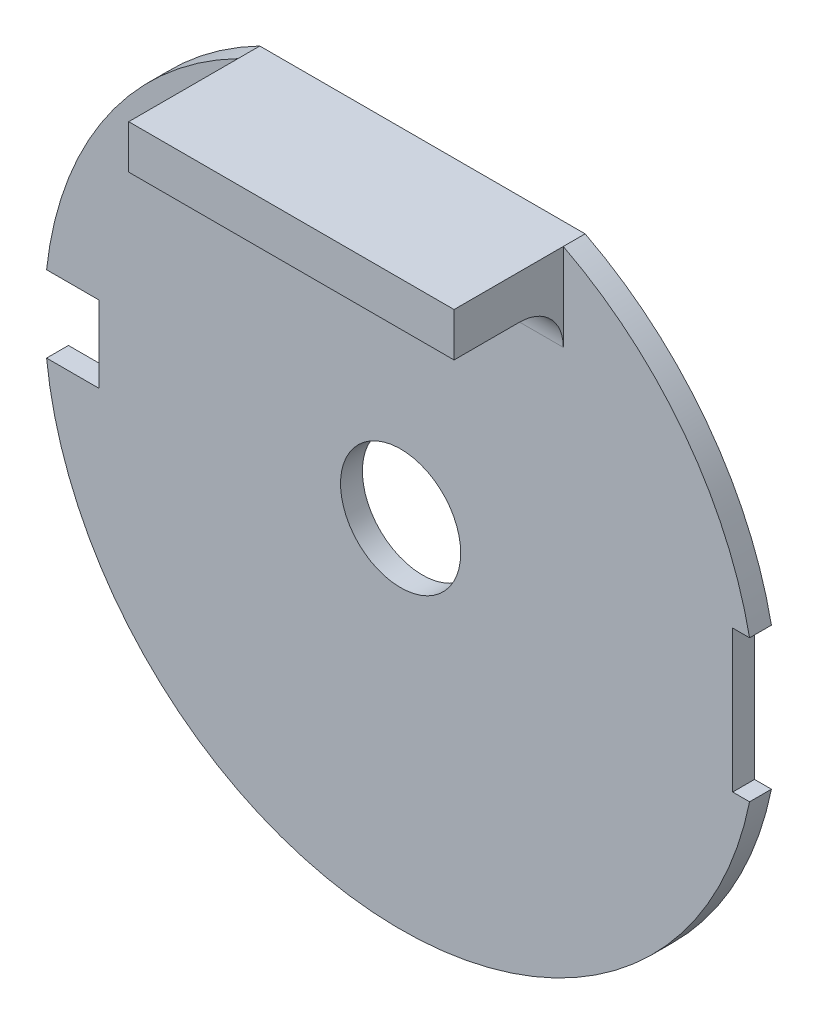
ISO-10303-21;
HEADER;
FILE_DESCRIPTION(('STEP AP214'),'2;1');
FILE_NAME('part.step','',(''),(''),'','','');
FILE_SCHEMA(('AUTOMOTIVE_DESIGN { 1 0 10303 214 1 1 1 1 }'));
ENDSEC;
DATA;
#1=APPLICATION_CONTEXT('core data for automotive mechanical design processes');
#2=APPLICATION_PROTOCOL_DEFINITION('international standard','automotive_design',2000,#1);
#3=PRODUCT_CONTEXT('',#1,'mechanical');
#4=PRODUCT('Part','Part','',(#3));
#5=PRODUCT_RELATED_PRODUCT_CATEGORY('part','',(#4));
#6=PRODUCT_DEFINITION_FORMATION('','',#4);
#7=PRODUCT_DEFINITION_CONTEXT('part definition',#1,'design');
#8=PRODUCT_DEFINITION('design','',#6,#7);
#9=PRODUCT_DEFINITION_SHAPE('','',#8);
#10=(LENGTH_UNIT() NAMED_UNIT(*) SI_UNIT(.MILLI.,.METRE.));
#11=(NAMED_UNIT(*) PLANE_ANGLE_UNIT() SI_UNIT($,.RADIAN.));
#12=(NAMED_UNIT(*) SI_UNIT($,.STERADIAN.) SOLID_ANGLE_UNIT());
#13=UNCERTAINTY_MEASURE_WITH_UNIT(LENGTH_MEASURE(1.E-05),#10,'distance_accuracy_value','');
#14=(GEOMETRIC_REPRESENTATION_CONTEXT(3) GLOBAL_UNCERTAINTY_ASSIGNED_CONTEXT((#13)) GLOBAL_UNIT_ASSIGNED_CONTEXT((#10,
#11,#12)) REPRESENTATION_CONTEXT('',''));
#15=CARTESIAN_POINT('',(0.,0.,0.));
#16=DIRECTION('',(0.,0.,1.));
#17=DIRECTION('',(1.,0.,0.));
#18=AXIS2_PLACEMENT_3D('',#15,#16,#17);
#19=CARTESIAN_POINT('',(0.,0.,1.));
#20=DIRECTION('',(0.,0.,-1.));
#21=DIRECTION('',(-1.,0.,0.));
#22=AXIS2_PLACEMENT_3D('',#19,#20,#21);
#23=CYLINDRICAL_SURFACE('',#22,16.3);
#24=CARTESIAN_POINT('',(0.,0.,0.));
#25=DIRECTION('',(0.,0.,1.));
#26=DIRECTION('',(1.,0.,0.));
#27=AXIS2_PLACEMENT_3D('',#24,#25,#26);
#28=CIRCLE('',#27,16.3);
#29=CARTESIAN_POINT('',(-7.44580418759452,14.5,0.));
#30=VERTEX_POINT('',#29);
#31=CARTESIAN_POINT('',(-16.2057860037704,1.75,0.));
#32=VERTEX_POINT('',#31);
#33=EDGE_CURVE('E245',#30,#32,#28,.T.);
#34=ORIENTED_EDGE('',*,*,#33,.T.);
#35=DIRECTION('',(0.,0.,-1.));
#36=VECTOR('',#35,1.);
#37=CARTESIAN_POINT('',(-16.2057860037704,1.75,1.));
#38=LINE('',#37,#36);
#39=CARTESIAN_POINT('',(-16.2057860037704,1.75,1.));
#40=VERTEX_POINT('',#39);
#41=EDGE_CURVE('E272',#32,#40,#38,.F.);
#42=ORIENTED_EDGE('',*,*,#41,.T.);
#43=CARTESIAN_POINT('',(0.,0.,1.));
#44=DIRECTION('',(0.,0.,1.));
#45=DIRECTION('',(1.,0.,0.));
#46=AXIS2_PLACEMENT_3D('',#43,#44,#45);
#47=CIRCLE('',#46,16.3);
#48=CARTESIAN_POINT('',(-7.44580418759452,14.5,1.));
#49=VERTEX_POINT('',#48);
#50=EDGE_CURVE('E238',#49,#40,#47,.T.);
#51=ORIENTED_EDGE('',*,*,#50,.F.);
#52=DIRECTION('',(0.,0.,-1.));
#53=VECTOR('',#52,1.);
#54=CARTESIAN_POINT('',(-7.44580418759452,14.5,1.));
#55=LINE('',#54,#53);
#56=EDGE_CURVE('E242',#49,#30,#55,.T.);
#57=ORIENTED_EDGE('',*,*,#56,.T.);
#58=EDGE_LOOP('',(#34,#42,#51,#57));
#59=FACE_BOUND('',#58,.T.);
#60=ADVANCED_FACE('F39',(#59),#23,.T.);
#61=CARTESIAN_POINT('',(15.9727111036292,3.25,1.));
#62=VERTEX_POINT('',#61);
#63=CARTESIAN_POINT('',(7.44580418759452,14.5,1.));
#64=VERTEX_POINT('',#63);
#65=EDGE_CURVE('E244',#62,#64,#47,.T.);
#66=ORIENTED_EDGE('',*,*,#65,.F.);
#67=DIRECTION('',(0.,0.,-1.));
#68=VECTOR('',#67,1.);
#69=CARTESIAN_POINT('',(15.9727111036292,3.25,1.));
#70=LINE('',#69,#68);
#71=CARTESIAN_POINT('',(15.9727111036292,3.25,0.));
#72=VERTEX_POINT('',#71);
#73=EDGE_CURVE('E264',#62,#72,#70,.T.);
#74=ORIENTED_EDGE('',*,*,#73,.T.);
#75=CARTESIAN_POINT('',(7.44580418759452,14.5,0.));
#76=VERTEX_POINT('',#75);
#77=EDGE_CURVE('E234',#72,#76,#28,.T.);
#78=ORIENTED_EDGE('',*,*,#77,.T.);
#79=DIRECTION('',(0.,0.,-1.));
#80=VECTOR('',#79,1.);
#81=CARTESIAN_POINT('',(7.44580418759452,14.5,1.));
#82=LINE('',#81,#80);
#83=EDGE_CURVE('E256',#64,#76,#82,.T.);
#84=ORIENTED_EDGE('',*,*,#83,.F.);
#85=EDGE_LOOP('',(#66,#74,#78,#84));
#86=FACE_BOUND('',#85,.T.);
#87=ADVANCED_FACE('F313',(#86),#23,.T.);
#88=CARTESIAN_POINT('',(0.,0.,1.));
#89=DIRECTION('',(0.,0.,1.));
#90=DIRECTION('',(1.,0.,0.));
#91=AXIS2_PLACEMENT_3D('',#88,#89,#90);
#92=PLANE('',#91);
#93=DIRECTION('',(0.,1.,0.));
#94=VECTOR('',#93,1.);
#95=CARTESIAN_POINT('',(7.44580418759452,14.5,1.));
#96=LINE('',#95,#94);
#97=CARTESIAN_POINT('',(7.44580418759452,10.5,1.));
#98=VERTEX_POINT('',#97);
#99=EDGE_CURVE('E55',#98,#64,#96,.T.);
#100=ORIENTED_EDGE('',*,*,#99,.F.);
#101=DIRECTION('',(1.,0.,0.));
#102=VECTOR('',#101,1.);
#103=CARTESIAN_POINT('',(0.,10.5,1.));
#104=LINE('',#103,#102);
#105=CARTESIAN_POINT('',(-7.44580418759452,10.5,1.));
#106=VERTEX_POINT('',#105);
#107=EDGE_CURVE('E279',#98,#106,#104,.F.);
#108=ORIENTED_EDGE('',*,*,#107,.T.);
#109=DIRECTION('',(0.,-1.,0.));
#110=VECTOR('',#109,1.);
#111=CARTESIAN_POINT('',(-7.44580418759452,14.5,1.));
#112=LINE('',#111,#110);
#113=EDGE_CURVE('E62',#49,#106,#112,.T.);
#114=ORIENTED_EDGE('',*,*,#113,.F.);
#115=ORIENTED_EDGE('',*,*,#50,.T.);
#116=DIRECTION('',(-1.,0.,0.));
#117=VECTOR('',#116,1.);
#118=CARTESIAN_POINT('',(-18.8,1.75,1.));
#119=LINE('',#118,#117);
#120=CARTESIAN_POINT('',(-13.8,1.75,1.));
#121=VERTEX_POINT('',#120);
#122=EDGE_CURVE('E181',#121,#40,#119,.T.);
#123=ORIENTED_EDGE('',*,*,#122,.F.);
#124=DIRECTION('',(0.,1.,0.));
#125=VECTOR('',#124,1.);
#126=CARTESIAN_POINT('',(-13.8,1.75,1.));
#127=LINE('',#126,#125);
#128=CARTESIAN_POINT('',(-13.8,-1.75,1.));
#129=VERTEX_POINT('',#128);
#130=EDGE_CURVE('E193',#129,#121,#127,.T.);
#131=ORIENTED_EDGE('',*,*,#130,.F.);
#132=DIRECTION('',(1.,0.,0.));
#133=VECTOR('',#132,1.);
#134=CARTESIAN_POINT('',(-18.8,-1.75,1.));
#135=LINE('',#134,#133);
#136=CARTESIAN_POINT('',(-16.2057860037704,-1.75,1.));
#137=VERTEX_POINT('',#136);
#138=EDGE_CURVE('E190',#137,#129,#135,.T.);
#139=ORIENTED_EDGE('',*,*,#138,.F.);
#140=CARTESIAN_POINT('',(15.9727111036292,-3.25,1.));
#141=VERTEX_POINT('',#140);
#142=EDGE_CURVE('E243',#137,#141,#47,.T.);
#143=ORIENTED_EDGE('',*,*,#142,.T.);
#144=DIRECTION('',(1.,0.,0.));
#145=VECTOR('',#144,1.);
#146=CARTESIAN_POINT('',(15.2,-3.25,1.));
#147=LINE('',#146,#145);
#148=CARTESIAN_POINT('',(15.2,-3.25,1.));
#149=VERTEX_POINT('',#148);
#150=EDGE_CURVE('E170',#149,#141,#147,.T.);
#151=ORIENTED_EDGE('',*,*,#150,.F.);
#152=DIRECTION('',(0.,-1.,0.));
#153=VECTOR('',#152,1.);
#154=CARTESIAN_POINT('',(15.2,3.25,1.));
#155=LINE('',#154,#153);
#156=CARTESIAN_POINT('',(15.2,3.25,1.));
#157=VERTEX_POINT('',#156);
#158=EDGE_CURVE('E165',#157,#149,#155,.T.);
#159=ORIENTED_EDGE('',*,*,#158,.F.);
#160=DIRECTION('',(-1.,0.,0.));
#161=VECTOR('',#160,1.);
#162=CARTESIAN_POINT('',(15.2,3.25,1.));
#163=LINE('',#162,#161);
#164=EDGE_CURVE('E212',#62,#157,#163,.T.);
#165=ORIENTED_EDGE('',*,*,#164,.F.);
#166=ORIENTED_EDGE('',*,*,#65,.T.);
#167=EDGE_LOOP('',(#100,#108,#114,#115,#123,#131,#139,#143,#151,#159,#165,#166));
#168=FACE_BOUND('',#167,.T.);
#169=CARTESIAN_POINT('',(0.,0.,1.));
#170=DIRECTION('',(0.,0.,1.));
#171=DIRECTION('',(1.,0.,0.));
#172=AXIS2_PLACEMENT_3D('',#169,#170,#171);
#173=CIRCLE('',#172,2.75);
#174=CARTESIAN_POINT('',(2.75,0.,1.));
#175=VERTEX_POINT('',#174);
#176=EDGE_CURVE('E230',#175,#175,#173,.T.);
#177=ORIENTED_EDGE('',*,*,#176,.F.);
#178=EDGE_LOOP('',(#177));
#179=FACE_BOUND('',#178,.T.);
#180=ADVANCED_FACE('F288',(#168,#179),#92,.T.);
#181=CARTESIAN_POINT('',(0.,0.,0.));
#182=DIRECTION('',(0.,0.,1.));
#183=DIRECTION('',(1.,0.,0.));
#184=AXIS2_PLACEMENT_3D('',#181,#182,#183);
#185=PLANE('',#184);
#186=DIRECTION('',(0.,1.,0.));
#187=VECTOR('',#186,1.);
#188=CARTESIAN_POINT('',(-13.8,1.75,0.));
#189=LINE('',#188,#187);
#190=CARTESIAN_POINT('',(-13.8,-1.75,0.));
#191=VERTEX_POINT('',#190);
#192=CARTESIAN_POINT('',(-13.8,1.75,0.));
#193=VERTEX_POINT('',#192);
#194=EDGE_CURVE('E180',#191,#193,#189,.T.);
#195=ORIENTED_EDGE('',*,*,#194,.T.);
#196=DIRECTION('',(-1.,0.,0.));
#197=VECTOR('',#196,1.);
#198=CARTESIAN_POINT('',(-18.8,1.75,0.));
#199=LINE('',#198,#197);
#200=EDGE_CURVE('E185',#193,#32,#199,.T.);
#201=ORIENTED_EDGE('',*,*,#200,.T.);
#202=ORIENTED_EDGE('',*,*,#33,.F.);
#203=DIRECTION('',(-1.,0.,0.));
#204=VECTOR('',#203,1.);
#205=CARTESIAN_POINT('',(-7.44580418759452,14.5,0.));
#206=LINE('',#205,#204);
#207=EDGE_CURVE('E249',#76,#30,#206,.T.);
#208=ORIENTED_EDGE('',*,*,#207,.F.);
#209=ORIENTED_EDGE('',*,*,#77,.F.);
#210=DIRECTION('',(-1.,0.,0.));
#211=VECTOR('',#210,1.);
#212=CARTESIAN_POINT('',(15.2,3.25,0.));
#213=LINE('',#212,#211);
#214=CARTESIAN_POINT('',(15.2,3.25,0.));
#215=VERTEX_POINT('',#214);
#216=EDGE_CURVE('E216',#72,#215,#213,.T.);
#217=ORIENTED_EDGE('',*,*,#216,.T.);
#218=DIRECTION('',(0.,-1.,0.));
#219=VECTOR('',#218,1.);
#220=CARTESIAN_POINT('',(15.2,3.25,0.));
#221=LINE('',#220,#219);
#222=CARTESIAN_POINT('',(15.2,-3.25,0.));
#223=VERTEX_POINT('',#222);
#224=EDGE_CURVE('E207',#215,#223,#221,.T.);
#225=ORIENTED_EDGE('',*,*,#224,.T.);
#226=DIRECTION('',(1.,0.,0.));
#227=VECTOR('',#226,1.);
#228=CARTESIAN_POINT('',(15.2,-3.25,0.));
#229=LINE('',#228,#227);
#230=CARTESIAN_POINT('',(15.9727111036292,-3.25,0.));
#231=VERTEX_POINT('',#230);
#232=EDGE_CURVE('E211',#223,#231,#229,.T.);
#233=ORIENTED_EDGE('',*,*,#232,.T.);
#234=CARTESIAN_POINT('',(-16.2057860037704,-1.75,0.));
#235=VERTEX_POINT('',#234);
#236=EDGE_CURVE('E250',#235,#231,#28,.T.);
#237=ORIENTED_EDGE('',*,*,#236,.F.);
#238=DIRECTION('',(1.,0.,0.));
#239=VECTOR('',#238,1.);
#240=CARTESIAN_POINT('',(-18.8,-1.75,0.));
#241=LINE('',#240,#239);
#242=EDGE_CURVE('E176',#235,#191,#241,.T.);
#243=ORIENTED_EDGE('',*,*,#242,.T.);
#244=EDGE_LOOP('',(#195,#201,#202,#208,#209,#217,#225,#233,#237,#243));
#245=FACE_BOUND('',#244,.T.);
#246=CARTESIAN_POINT('',(0.,0.,0.));
#247=DIRECTION('',(0.,0.,1.));
#248=DIRECTION('',(1.,0.,0.));
#249=AXIS2_PLACEMENT_3D('',#246,#247,#248);
#250=CIRCLE('',#249,2.75);
#251=CARTESIAN_POINT('',(2.75,0.,0.));
#252=VERTEX_POINT('',#251);
#253=EDGE_CURVE('E203',#252,#252,#250,.T.);
#254=ORIENTED_EDGE('',*,*,#253,.T.);
#255=EDGE_LOOP('',(#254));
#256=FACE_BOUND('',#255,.T.);
#257=ADVANCED_FACE('F317',(#245,#256),#185,.F.);
#258=ORIENTED_EDGE('',*,*,#142,.F.);
#259=DIRECTION('',(0.,0.,-1.));
#260=VECTOR('',#259,1.);
#261=CARTESIAN_POINT('',(-16.2057860037704,-1.75,1.));
#262=LINE('',#261,#260);
#263=EDGE_CURVE('E268',#137,#235,#262,.T.);
#264=ORIENTED_EDGE('',*,*,#263,.T.);
#265=ORIENTED_EDGE('',*,*,#236,.T.);
#266=DIRECTION('',(0.,0.,-1.));
#267=VECTOR('',#266,1.);
#268=CARTESIAN_POINT('',(15.9727111036292,-3.25,1.));
#269=LINE('',#268,#267);
#270=EDGE_CURVE('E260',#231,#141,#269,.F.);
#271=ORIENTED_EDGE('',*,*,#270,.T.);
#272=EDGE_LOOP('',(#258,#264,#265,#271));
#273=FACE_BOUND('',#272,.T.);
#274=ADVANCED_FACE('F334',(#273),#23,.T.);
#275=CARTESIAN_POINT('',(-7.44580418759452,14.5,1.));
#276=DIRECTION('',(0.,-1.,0.));
#277=DIRECTION('',(0.,0.,-1.));
#278=AXIS2_PLACEMENT_3D('',#275,#276,#277);
#279=PLANE('',#278);
#280=ORIENTED_EDGE('',*,*,#207,.T.);
#281=ORIENTED_EDGE('',*,*,#56,.F.);
#282=DIRECTION('',(0.,0.,-1.));
#283=VECTOR('',#282,1.);
#284=CARTESIAN_POINT('',(-7.44580418759452,14.5,6.));
#285=LINE('',#284,#283);
#286=CARTESIAN_POINT('',(-7.44580418759452,14.5,6.));
#287=VERTEX_POINT('',#286);
#288=EDGE_CURVE('E297',#287,#49,#285,.T.);
#289=ORIENTED_EDGE('',*,*,#288,.F.);
#290=DIRECTION('',(-1.,0.,0.));
#291=VECTOR('',#290,1.);
#292=CARTESIAN_POINT('',(-7.44580418759452,14.5,6.));
#293=LINE('',#292,#291);
#294=CARTESIAN_POINT('',(7.44580418759452,14.5,6.));
#295=VERTEX_POINT('',#294);
#296=EDGE_CURVE('E158',#295,#287,#293,.T.);
#297=ORIENTED_EDGE('',*,*,#296,.F.);
#298=DIRECTION('',(0.,0.,-1.));
#299=VECTOR('',#298,1.);
#300=CARTESIAN_POINT('',(7.44580418759452,14.5,6.));
#301=LINE('',#300,#299);
#302=EDGE_CURVE('E172',#295,#64,#301,.T.);
#303=ORIENTED_EDGE('',*,*,#302,.T.);
#304=ORIENTED_EDGE('',*,*,#83,.T.);
#305=EDGE_LOOP('',(#280,#281,#289,#297,#303,#304));
#306=FACE_BOUND('',#305,.T.);
#307=ADVANCED_FACE('F296',(#306),#279,.F.);
#308=CARTESIAN_POINT('',(0.,0.,1.));
#309=DIRECTION('',(0.,0.,-1.));
#310=DIRECTION('',(-1.,0.,0.));
#311=AXIS2_PLACEMENT_3D('',#308,#309,#310);
#312=CYLINDRICAL_SURFACE('',#311,2.75);
#313=ORIENTED_EDGE('',*,*,#176,.T.);
#314=EDGE_LOOP('',(#313));
#315=FACE_BOUND('',#314,.T.);
#316=ORIENTED_EDGE('',*,*,#253,.F.);
#317=EDGE_LOOP('',(#316));
#318=FACE_BOUND('',#317,.T.);
#319=ADVANCED_FACE('F350',(#315,#318),#312,.F.);
#320=CARTESIAN_POINT('',(15.2,3.25,0.));
#321=DIRECTION('',(0.,1.,0.));
#322=DIRECTION('',(0.,0.,1.));
#323=AXIS2_PLACEMENT_3D('',#320,#321,#322);
#324=PLANE('',#323);
#325=ORIENTED_EDGE('',*,*,#164,.T.);
#326=DIRECTION('',(0.,0.,1.));
#327=VECTOR('',#326,1.);
#328=CARTESIAN_POINT('',(15.2,3.25,0.));
#329=LINE('',#328,#327);
#330=EDGE_CURVE('E194',#215,#157,#329,.T.);
#331=ORIENTED_EDGE('',*,*,#330,.F.);
#332=ORIENTED_EDGE('',*,*,#216,.F.);
#333=ORIENTED_EDGE('',*,*,#73,.F.);
#334=EDGE_LOOP('',(#325,#331,#332,#333));
#335=FACE_BOUND('',#334,.T.);
#336=ADVANCED_FACE('F348',(#335),#324,.F.);
#337=CARTESIAN_POINT('',(15.2,-3.25,0.));
#338=DIRECTION('',(0.,-1.,0.));
#339=DIRECTION('',(0.,0.,-1.));
#340=AXIS2_PLACEMENT_3D('',#337,#338,#339);
#341=PLANE('',#340);
#342=ORIENTED_EDGE('',*,*,#232,.F.);
#343=DIRECTION('',(0.,0.,1.));
#344=VECTOR('',#343,1.);
#345=CARTESIAN_POINT('',(15.2,-3.25,0.));
#346=LINE('',#345,#344);
#347=EDGE_CURVE('E219',#223,#149,#346,.T.);
#348=ORIENTED_EDGE('',*,*,#347,.T.);
#349=ORIENTED_EDGE('',*,*,#150,.T.);
#350=ORIENTED_EDGE('',*,*,#270,.F.);
#351=EDGE_LOOP('',(#342,#348,#349,#350));
#352=FACE_BOUND('',#351,.T.);
#353=ADVANCED_FACE('F343',(#352),#341,.F.);
#354=CARTESIAN_POINT('',(15.2,3.25,0.));
#355=DIRECTION('',(-1.,0.,0.));
#356=DIRECTION('',(0.,0.,1.));
#357=AXIS2_PLACEMENT_3D('',#354,#355,#356);
#358=PLANE('',#357);
#359=ORIENTED_EDGE('',*,*,#158,.T.);
#360=ORIENTED_EDGE('',*,*,#347,.F.);
#361=ORIENTED_EDGE('',*,*,#224,.F.);
#362=ORIENTED_EDGE('',*,*,#330,.T.);
#363=EDGE_LOOP('',(#359,#360,#361,#362));
#364=FACE_BOUND('',#363,.T.);
#365=ADVANCED_FACE('F346',(#364),#358,.F.);
#366=CARTESIAN_POINT('',(-18.8,1.75,0.));
#367=DIRECTION('',(0.,1.,0.));
#368=DIRECTION('',(0.,0.,1.));
#369=AXIS2_PLACEMENT_3D('',#366,#367,#368);
#370=PLANE('',#369);
#371=ORIENTED_EDGE('',*,*,#200,.F.);
#372=DIRECTION('',(0.,0.,1.));
#373=VECTOR('',#372,1.);
#374=CARTESIAN_POINT('',(-13.8,1.75,0.));
#375=LINE('',#374,#373);
#376=EDGE_CURVE('E200',#193,#121,#375,.T.);
#377=ORIENTED_EDGE('',*,*,#376,.T.);
#378=ORIENTED_EDGE('',*,*,#122,.T.);
#379=ORIENTED_EDGE('',*,*,#41,.F.);
#380=EDGE_LOOP('',(#371,#377,#378,#379));
#381=FACE_BOUND('',#380,.T.);
#382=ADVANCED_FACE('F322',(#381),#370,.F.);
#383=CARTESIAN_POINT('',(-18.8,-1.75,0.));
#384=DIRECTION('',(0.,-1.,0.));
#385=DIRECTION('',(0.,0.,-1.));
#386=AXIS2_PLACEMENT_3D('',#383,#384,#385);
#387=PLANE('',#386);
#388=ORIENTED_EDGE('',*,*,#138,.T.);
#389=DIRECTION('',(0.,0.,1.));
#390=VECTOR('',#389,1.);
#391=CARTESIAN_POINT('',(-13.8,-1.75,0.));
#392=LINE('',#391,#390);
#393=EDGE_CURVE('E189',#191,#129,#392,.T.);
#394=ORIENTED_EDGE('',*,*,#393,.F.);
#395=ORIENTED_EDGE('',*,*,#242,.F.);
#396=ORIENTED_EDGE('',*,*,#263,.F.);
#397=EDGE_LOOP('',(#388,#394,#395,#396));
#398=FACE_BOUND('',#397,.T.);
#399=ADVANCED_FACE('F330',(#398),#387,.F.);
#400=CARTESIAN_POINT('',(-13.8,1.75,0.));
#401=DIRECTION('',(1.,0.,0.));
#402=DIRECTION('',(0.,0.,-1.));
#403=AXIS2_PLACEMENT_3D('',#400,#401,#402);
#404=PLANE('',#403);
#405=ORIENTED_EDGE('',*,*,#130,.T.);
#406=ORIENTED_EDGE('',*,*,#376,.F.);
#407=ORIENTED_EDGE('',*,*,#194,.F.);
#408=ORIENTED_EDGE('',*,*,#393,.T.);
#409=EDGE_LOOP('',(#405,#406,#407,#408));
#410=FACE_BOUND('',#409,.T.);
#411=ADVANCED_FACE('F328',(#410),#404,.F.);
#412=CARTESIAN_POINT('',(-7.44580418759452,14.5,6.));
#413=DIRECTION('',(1.,0.,0.));
#414=DIRECTION('',(0.,0.,-1.));
#415=AXIS2_PLACEMENT_3D('',#412,#413,#414);
#416=PLANE('',#415);
#417=ORIENTED_EDGE('',*,*,#113,.T.);
#418=CARTESIAN_POINT('',(-7.44580418759452,10.5,3.));
#419=DIRECTION('',(1.,0.,0.));
#420=DIRECTION('',(0.,0.,-1.));
#421=AXIS2_PLACEMENT_3D('',#418,#419,#420);
#422=CIRCLE('',#421,2.);
#423=CARTESIAN_POINT('',(-7.44580418759452,12.5,3.));
#424=VERTEX_POINT('',#423);
#425=EDGE_CURVE('E11',#106,#424,#422,.T.);
#426=ORIENTED_EDGE('',*,*,#425,.T.);
#427=DIRECTION('',(0.,0.,-1.));
#428=VECTOR('',#427,1.);
#429=CARTESIAN_POINT('',(-7.44580418759452,12.5,6.));
#430=LINE('',#429,#428);
#431=CARTESIAN_POINT('',(-7.44580418759452,12.5,6.));
#432=VERTEX_POINT('',#431);
#433=EDGE_CURVE('E145',#432,#424,#430,.T.);
#434=ORIENTED_EDGE('',*,*,#433,.F.);
#435=DIRECTION('',(0.,-1.,0.));
#436=VECTOR('',#435,1.);
#437=CARTESIAN_POINT('',(-7.44580418759452,14.5,6.));
#438=LINE('',#437,#436);
#439=EDGE_CURVE('E153',#287,#432,#438,.T.);
#440=ORIENTED_EDGE('',*,*,#439,.F.);
#441=ORIENTED_EDGE('',*,*,#288,.T.);
#442=EDGE_LOOP('',(#417,#426,#434,#440,#441));
#443=FACE_BOUND('',#442,.T.);
#444=ADVANCED_FACE('F162',(#443),#416,.F.);
#445=CARTESIAN_POINT('',(-7.44580418759452,12.5,6.));
#446=DIRECTION('',(0.,1.,0.));
#447=DIRECTION('',(0.,0.,1.));
#448=AXIS2_PLACEMENT_3D('',#445,#446,#447);
#449=PLANE('',#448);
#450=ORIENTED_EDGE('',*,*,#433,.T.);
#451=DIRECTION('',(1.,0.,0.));
#452=VECTOR('',#451,1.);
#453=CARTESIAN_POINT('',(-7.44580418759452,12.5,3.));
#454=LINE('',#453,#452);
#455=CARTESIAN_POINT('',(7.44580418759452,12.5,3.));
#456=VERTEX_POINT('',#455);
#457=EDGE_CURVE('E276',#424,#456,#454,.T.);
#458=ORIENTED_EDGE('',*,*,#457,.T.);
#459=DIRECTION('',(0.,0.,-1.));
#460=VECTOR('',#459,1.);
#461=CARTESIAN_POINT('',(7.44580418759452,12.5,6.));
#462=LINE('',#461,#460);
#463=CARTESIAN_POINT('',(7.44580418759452,12.5,6.));
#464=VERTEX_POINT('',#463);
#465=EDGE_CURVE('E148',#464,#456,#462,.T.);
#466=ORIENTED_EDGE('',*,*,#465,.F.);
#467=DIRECTION('',(1.,0.,0.));
#468=VECTOR('',#467,1.);
#469=CARTESIAN_POINT('',(-7.44580418759452,12.5,6.));
#470=LINE('',#469,#468);
#471=EDGE_CURVE('E140',#432,#464,#470,.T.);
#472=ORIENTED_EDGE('',*,*,#471,.F.);
#473=EDGE_LOOP('',(#450,#458,#466,#472));
#474=FACE_BOUND('',#473,.T.);
#475=ADVANCED_FACE('F142',(#474),#449,.F.);
#476=CARTESIAN_POINT('',(7.44580418759452,14.5,6.));
#477=DIRECTION('',(-1.,0.,0.));
#478=DIRECTION('',(0.,0.,1.));
#479=AXIS2_PLACEMENT_3D('',#476,#477,#478);
#480=PLANE('',#479);
#481=ORIENTED_EDGE('',*,*,#99,.T.);
#482=ORIENTED_EDGE('',*,*,#302,.F.);
#483=DIRECTION('',(0.,1.,0.));
#484=VECTOR('',#483,1.);
#485=CARTESIAN_POINT('',(7.44580418759452,14.5,6.));
#486=LINE('',#485,#484);
#487=EDGE_CURVE('E152',#464,#295,#486,.T.);
#488=ORIENTED_EDGE('',*,*,#487,.F.);
#489=ORIENTED_EDGE('',*,*,#465,.T.);
#490=CARTESIAN_POINT('',(7.44580418759452,10.5,3.));
#491=DIRECTION('',(-1.,0.,0.));
#492=DIRECTION('',(0.,0.,1.));
#493=AXIS2_PLACEMENT_3D('',#490,#491,#492);
#494=CIRCLE('',#493,2.);
#495=EDGE_CURVE('E48',#456,#98,#494,.T.);
#496=ORIENTED_EDGE('',*,*,#495,.T.);
#497=EDGE_LOOP('',(#481,#482,#488,#489,#496));
#498=FACE_BOUND('',#497,.T.);
#499=ADVANCED_FACE('F284',(#498),#480,.F.);
#500=CARTESIAN_POINT('',(0.,0.,6.));
#501=DIRECTION('',(0.,0.,1.));
#502=DIRECTION('',(1.,0.,0.));
#503=AXIS2_PLACEMENT_3D('',#500,#501,#502);
#504=PLANE('',#503);
#505=ORIENTED_EDGE('',*,*,#439,.T.);
#506=ORIENTED_EDGE('',*,*,#471,.T.);
#507=ORIENTED_EDGE('',*,*,#487,.T.);
#508=ORIENTED_EDGE('',*,*,#296,.T.);
#509=EDGE_LOOP('',(#505,#506,#507,#508));
#510=FACE_BOUND('',#509,.T.);
#511=ADVANCED_FACE('F156',(#510),#504,.T.);
#512=CARTESIAN_POINT('',(-7.44580418759452,10.5,3.));
#513=DIRECTION('',(1.,0.,0.));
#514=DIRECTION('',(0.,0.,-1.));
#515=AXIS2_PLACEMENT_3D('',#512,#513,#514);
#516=CYLINDRICAL_SURFACE('',#515,2.);
#517=ORIENTED_EDGE('',*,*,#425,.F.);
#518=ORIENTED_EDGE('',*,*,#107,.F.);
#519=ORIENTED_EDGE('',*,*,#495,.F.);
#520=ORIENTED_EDGE('',*,*,#457,.F.);
#521=EDGE_LOOP('',(#517,#518,#519,#520));
#522=FACE_BOUND('',#521,.T.);
#523=ADVANCED_FACE('F41',(#522),#516,.F.);
#524=CLOSED_SHELL('',(#60,#87,#180,#257,#274,#307,#319,#336,#353,#365,#382,#399,#411,#444,#475,
#499,#511,#523));
#525=MANIFOLD_SOLID_BREP('B2',#524);
#526=ADVANCED_BREP_SHAPE_REPRESENTATION('',(#18,#525),#14);
#527=SHAPE_DEFINITION_REPRESENTATION(#9,#526);
ENDSEC;
END-ISO-10303-21;
